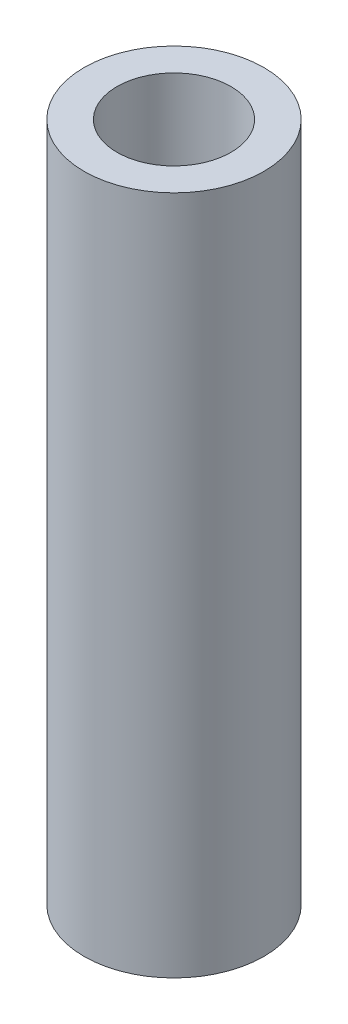
ISO-10303-21;
HEADER;
FILE_DESCRIPTION(('STEP AP214'),'2;1');
FILE_NAME('part.step','',(''),(''),'','','');
FILE_SCHEMA(('AUTOMOTIVE_DESIGN { 1 0 10303 214 1 1 1 1 }'));
ENDSEC;
DATA;
#1=APPLICATION_CONTEXT('core data for automotive mechanical design processes');
#2=APPLICATION_PROTOCOL_DEFINITION('international standard','automotive_design',2000,#1);
#3=PRODUCT_CONTEXT('',#1,'mechanical');
#4=PRODUCT('Part','Part','',(#3));
#5=PRODUCT_RELATED_PRODUCT_CATEGORY('part','',(#4));
#6=PRODUCT_DEFINITION_FORMATION('','',#4);
#7=PRODUCT_DEFINITION_CONTEXT('part definition',#1,'design');
#8=PRODUCT_DEFINITION('design','',#6,#7);
#9=PRODUCT_DEFINITION_SHAPE('','',#8);
#10=(LENGTH_UNIT() NAMED_UNIT(*) SI_UNIT(.MILLI.,.METRE.));
#11=(NAMED_UNIT(*) PLANE_ANGLE_UNIT() SI_UNIT($,.RADIAN.));
#12=(NAMED_UNIT(*) SI_UNIT($,.STERADIAN.) SOLID_ANGLE_UNIT());
#13=UNCERTAINTY_MEASURE_WITH_UNIT(LENGTH_MEASURE(1.E-05),#10,'distance_accuracy_value','');
#14=(GEOMETRIC_REPRESENTATION_CONTEXT(3) GLOBAL_UNCERTAINTY_ASSIGNED_CONTEXT((#13)) GLOBAL_UNIT_ASSIGNED_CONTEXT((#10,
#11,#12)) REPRESENTATION_CONTEXT('',''));
#15=CARTESIAN_POINT('',(0.,0.,0.));
#16=DIRECTION('',(0.,0.,1.));
#17=DIRECTION('',(1.,0.,0.));
#18=AXIS2_PLACEMENT_3D('',#15,#16,#17);
#19=CARTESIAN_POINT('',(0.,65.,0.));
#20=DIRECTION('',(0.,-1.,0.));
#21=DIRECTION('',(0.,0.,-1.));
#22=AXIS2_PLACEMENT_3D('',#19,#20,#21);
#23=CYLINDRICAL_SURFACE('',#22,4.7625);
#24=CARTESIAN_POINT('',(0.,5.,0.));
#25=DIRECTION('',(0.,-1.,0.));
#26=DIRECTION('',(0.,0.,-1.));
#27=AXIS2_PLACEMENT_3D('',#24,#25,#26);
#28=CIRCLE('',#27,4.7625);
#29=CARTESIAN_POINT('',(0.,5.00000000000001,-4.7625));
#30=VERTEX_POINT('',#29);
#31=EDGE_CURVE('E10',#30,#30,#28,.T.);
#32=ORIENTED_EDGE('',*,*,#31,.T.);
#33=EDGE_LOOP('',(#32));
#34=FACE_BOUND('',#33,.T.);
#35=CARTESIAN_POINT('',(0.,-31.,0.));
#36=DIRECTION('',(0.,1.,0.));
#37=DIRECTION('',(0.,0.,1.));
#38=AXIS2_PLACEMENT_3D('',#35,#36,#37);
#39=CIRCLE('',#38,4.7625);
#40=CARTESIAN_POINT('',(0.,-31.,4.7625));
#41=VERTEX_POINT('',#40);
#42=EDGE_CURVE('E42',#41,#41,#39,.T.);
#43=ORIENTED_EDGE('',*,*,#42,.T.);
#44=EDGE_LOOP('',(#43));
#45=FACE_BOUND('',#44,.T.);
#46=ADVANCED_FACE('F30',(#34,#45),#23,.T.);
#47=CARTESIAN_POINT('',(0.,65.,0.));
#48=DIRECTION('',(0.,-1.,0.));
#49=DIRECTION('',(0.,0.,-1.));
#50=AXIS2_PLACEMENT_3D('',#47,#48,#49);
#51=CYLINDRICAL_SURFACE('',#50,3.01897649096245);
#52=CARTESIAN_POINT('',(0.,-31.,0.));
#53=DIRECTION('',(0.,1.,0.));
#54=DIRECTION('',(0.,0.,1.));
#55=AXIS2_PLACEMENT_3D('',#52,#53,#54);
#56=CIRCLE('',#55,3.01897649096245);
#57=CARTESIAN_POINT('',(0.,-31.,3.01897649096245));
#58=VERTEX_POINT('',#57);
#59=EDGE_CURVE('E33',#58,#58,#56,.T.);
#60=ORIENTED_EDGE('',*,*,#59,.F.);
#61=EDGE_LOOP('',(#60));
#62=FACE_BOUND('',#61,.T.);
#63=CARTESIAN_POINT('',(0.,5.,0.));
#64=DIRECTION('',(0.,-1.,0.));
#65=DIRECTION('',(0.,0.,-1.));
#66=AXIS2_PLACEMENT_3D('',#63,#64,#65);
#67=CIRCLE('',#66,3.01897649096245);
#68=CARTESIAN_POINT('',(0.,5.,-3.01897649096245));
#69=VERTEX_POINT('',#68);
#70=EDGE_CURVE('E37',#69,#69,#67,.T.);
#71=ORIENTED_EDGE('',*,*,#70,.F.);
#72=EDGE_LOOP('',(#71));
#73=FACE_BOUND('',#72,.T.);
#74=ADVANCED_FACE('F53',(#62,#73),#51,.F.);
#75=CARTESIAN_POINT('',(-4.7625,5.,-15.5590167069306));
#76=DIRECTION('',(0.,-1.,0.));
#77=DIRECTION('',(0.,0.,-1.));
#78=AXIS2_PLACEMENT_3D('',#75,#76,#77);
#79=PLANE('',#78);
#80=ORIENTED_EDGE('',*,*,#70,.T.);
#81=EDGE_LOOP('',(#80));
#82=FACE_BOUND('',#81,.T.);
#83=ORIENTED_EDGE('',*,*,#31,.F.);
#84=EDGE_LOOP('',(#83));
#85=FACE_BOUND('',#84,.T.);
#86=ADVANCED_FACE('F56',(#82,#85),#79,.F.);
#87=CARTESIAN_POINT('',(-4.7625,-31.,21.7864896924764));
#88=DIRECTION('',(0.,1.,0.));
#89=DIRECTION('',(0.,0.,1.));
#90=AXIS2_PLACEMENT_3D('',#87,#88,#89);
#91=PLANE('',#90);
#92=ORIENTED_EDGE('',*,*,#59,.T.);
#93=EDGE_LOOP('',(#92));
#94=FACE_BOUND('',#93,.T.);
#95=ORIENTED_EDGE('',*,*,#42,.F.);
#96=EDGE_LOOP('',(#95));
#97=FACE_BOUND('',#96,.T.);
#98=ADVANCED_FACE('F50',(#94,#97),#91,.F.);
#99=CLOSED_SHELL('',(#46,#74,#86,#98));
#100=MANIFOLD_SOLID_BREP('B2',#99);
#101=ADVANCED_BREP_SHAPE_REPRESENTATION('',(#18,#100),#14);
#102=SHAPE_DEFINITION_REPRESENTATION(#9,#101);
ENDSEC;
END-ISO-10303-21;
